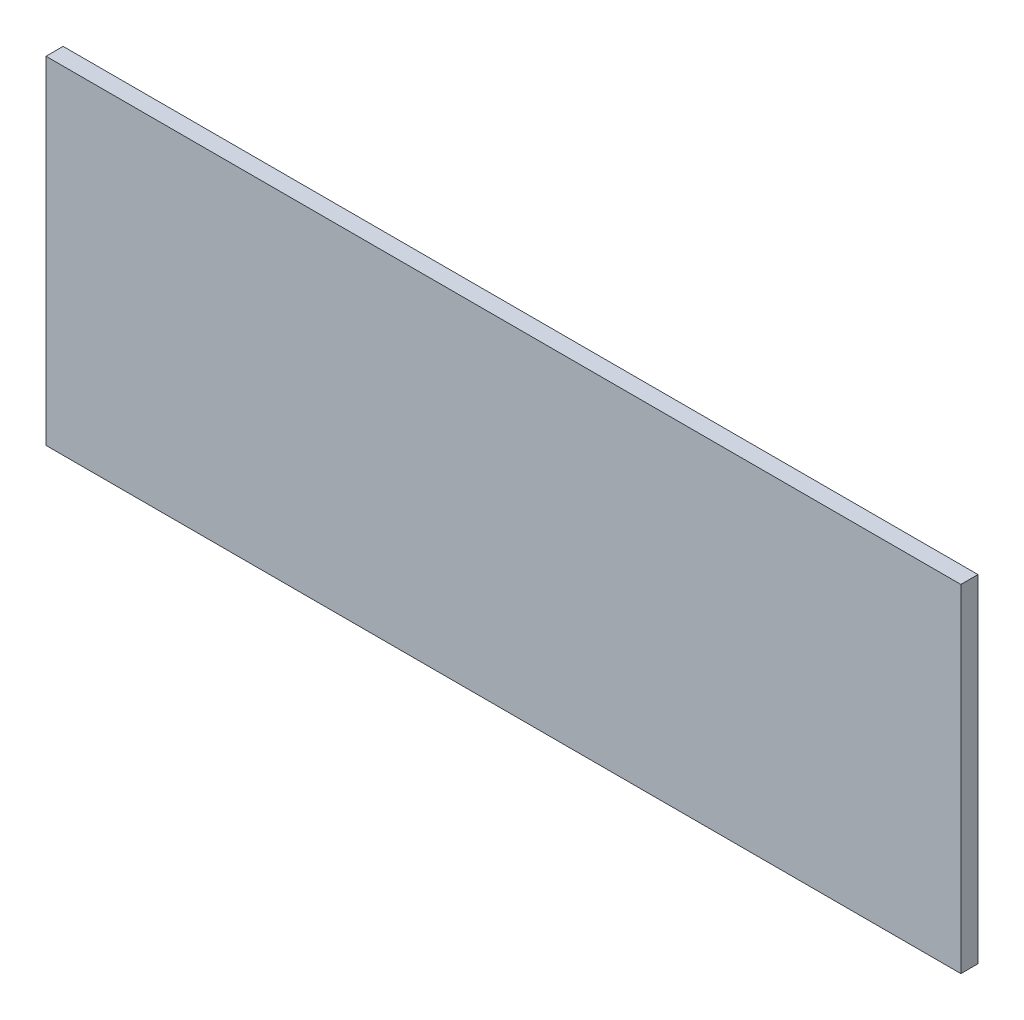
ISO-10303-21;
HEADER;
FILE_DESCRIPTION(('STEP AP214'),'2;1');
FILE_NAME('part.step','',(''),(''),'','','');
FILE_SCHEMA(('AUTOMOTIVE_DESIGN { 1 0 10303 214 1 1 1 1 }'));
ENDSEC;
DATA;
#1=APPLICATION_CONTEXT('core data for automotive mechanical design processes');
#2=APPLICATION_PROTOCOL_DEFINITION('international standard','automotive_design',2000,#1);
#3=PRODUCT_CONTEXT('',#1,'mechanical');
#4=PRODUCT('Part','Part','',(#3));
#5=PRODUCT_RELATED_PRODUCT_CATEGORY('part','',(#4));
#6=PRODUCT_DEFINITION_FORMATION('','',#4);
#7=PRODUCT_DEFINITION_CONTEXT('part definition',#1,'design');
#8=PRODUCT_DEFINITION('design','',#6,#7);
#9=PRODUCT_DEFINITION_SHAPE('','',#8);
#10=(LENGTH_UNIT() NAMED_UNIT(*) SI_UNIT(.MILLI.,.METRE.));
#11=(NAMED_UNIT(*) PLANE_ANGLE_UNIT() SI_UNIT($,.RADIAN.));
#12=(NAMED_UNIT(*) SI_UNIT($,.STERADIAN.) SOLID_ANGLE_UNIT());
#13=UNCERTAINTY_MEASURE_WITH_UNIT(LENGTH_MEASURE(1.E-05),#10,'distance_accuracy_value','');
#14=(GEOMETRIC_REPRESENTATION_CONTEXT(3) GLOBAL_UNCERTAINTY_ASSIGNED_CONTEXT((#13)) GLOBAL_UNIT_ASSIGNED_CONTEXT((#10,
#11,#12)) REPRESENTATION_CONTEXT('',''));
#15=CARTESIAN_POINT('',(0.,0.,0.));
#16=DIRECTION('',(0.,0.,1.));
#17=DIRECTION('',(1.,0.,0.));
#18=AXIS2_PLACEMENT_3D('',#15,#16,#17);
#19=CARTESIAN_POINT('',(96.5670013427734,71.3369979858398,0.));
#20=DIRECTION('',(0.,1.,0.));
#21=DIRECTION('',(1.,0.,0.));
#22=AXIS2_PLACEMENT_3D('',#19,#20,#21);
#23=PLANE('',#22);
#24=DIRECTION('',(1.,0.,0.));
#25=VECTOR('',#24,1.);
#26=CARTESIAN_POINT('',(96.5670013427734,71.3369979858398,0.03556));
#27=LINE('',#26,#25);
#28=CARTESIAN_POINT('',(96.5670013427734,71.3369979858398,0.03556));
#29=VERTEX_POINT('',#28);
#30=CARTESIAN_POINT('',(98.4670028686523,71.3369979858398,0.03556));
#31=VERTEX_POINT('',#30);
#32=EDGE_CURVE('E11',#29,#31,#27,.T.);
#33=ORIENTED_EDGE('',*,*,#32,.F.);
#34=DIRECTION('',(0.,0.,1.));
#35=VECTOR('',#34,1.);
#36=CARTESIAN_POINT('',(96.5670013427734,71.3369979858398,0.));
#37=LINE('',#36,#35);
#38=CARTESIAN_POINT('',(96.5670013427734,71.3369979858398,0.));
#39=VERTEX_POINT('',#38);
#40=EDGE_CURVE('E24',#39,#29,#37,.T.);
#41=ORIENTED_EDGE('',*,*,#40,.F.);
#42=DIRECTION('',(1.,0.,0.));
#43=VECTOR('',#42,1.);
#44=CARTESIAN_POINT('',(96.5670013427734,71.3369979858398,0.));
#45=LINE('',#44,#43);
#46=CARTESIAN_POINT('',(98.4670028686523,71.3369979858398,0.));
#47=VERTEX_POINT('',#46);
#48=EDGE_CURVE('E75',#39,#47,#45,.T.);
#49=ORIENTED_EDGE('',*,*,#48,.T.);
#50=DIRECTION('',(0.,0.,1.));
#51=VECTOR('',#50,1.);
#52=CARTESIAN_POINT('',(98.4670028686523,71.3369979858398,0.));
#53=LINE('',#52,#51);
#54=EDGE_CURVE('E37',#47,#31,#53,.T.);
#55=ORIENTED_EDGE('',*,*,#54,.T.);
#56=EDGE_LOOP('',(#33,#41,#49,#55));
#57=FACE_BOUND('',#56,.T.);
#58=ADVANCED_FACE('F17',(#57),#23,.F.);
#59=CARTESIAN_POINT('',(98.4670028686523,71.3369979858398,0.));
#60=DIRECTION('',(-1.,0.,0.));
#61=DIRECTION('',(0.,1.,0.));
#62=AXIS2_PLACEMENT_3D('',#59,#60,#61);
#63=PLANE('',#62);
#64=DIRECTION('',(0.,1.,0.));
#65=VECTOR('',#64,1.);
#66=CARTESIAN_POINT('',(98.4670028686523,71.3369979858398,0.03556));
#67=LINE('',#66,#65);
#68=CARTESIAN_POINT('',(98.4670028686523,72.0370025634766,0.03556));
#69=VERTEX_POINT('',#68);
#70=EDGE_CURVE('E83',#31,#69,#67,.T.);
#71=ORIENTED_EDGE('',*,*,#70,.F.);
#72=ORIENTED_EDGE('',*,*,#54,.F.);
#73=DIRECTION('',(0.,1.,0.));
#74=VECTOR('',#73,1.);
#75=CARTESIAN_POINT('',(98.4670028686523,71.3369979858398,0.));
#76=LINE('',#75,#74);
#77=CARTESIAN_POINT('',(98.4670028686523,72.0370025634766,0.));
#78=VERTEX_POINT('',#77);
#79=EDGE_CURVE('E81',#47,#78,#76,.T.);
#80=ORIENTED_EDGE('',*,*,#79,.T.);
#81=DIRECTION('',(0.,0.,1.));
#82=VECTOR('',#81,1.);
#83=CARTESIAN_POINT('',(98.4670028686523,72.0370025634766,0.));
#84=LINE('',#83,#82);
#85=EDGE_CURVE('E67',#78,#69,#84,.T.);
#86=ORIENTED_EDGE('',*,*,#85,.T.);
#87=EDGE_LOOP('',(#71,#72,#80,#86));
#88=FACE_BOUND('',#87,.T.);
#89=ADVANCED_FACE('F89',(#88),#63,.F.);
#90=CARTESIAN_POINT('',(98.4670028686523,72.0370025634766,0.));
#91=DIRECTION('',(0.,-1.,0.));
#92=DIRECTION('',(-1.,0.,0.));
#93=AXIS2_PLACEMENT_3D('',#90,#91,#92);
#94=PLANE('',#93);
#95=DIRECTION('',(-1.,0.,0.));
#96=VECTOR('',#95,1.);
#97=CARTESIAN_POINT('',(98.4670028686523,72.0370025634766,0.03556));
#98=LINE('',#97,#96);
#99=CARTESIAN_POINT('',(96.5670013427734,72.0370025634766,0.03556));
#100=VERTEX_POINT('',#99);
#101=EDGE_CURVE('E71',#69,#100,#98,.T.);
#102=ORIENTED_EDGE('',*,*,#101,.F.);
#103=ORIENTED_EDGE('',*,*,#85,.F.);
#104=DIRECTION('',(-1.,0.,0.));
#105=VECTOR('',#104,1.);
#106=CARTESIAN_POINT('',(98.4670028686523,72.0370025634766,0.));
#107=LINE('',#106,#105);
#108=CARTESIAN_POINT('',(96.5670013427734,72.0370025634766,0.));
#109=VERTEX_POINT('',#108);
#110=EDGE_CURVE('E63',#78,#109,#107,.T.);
#111=ORIENTED_EDGE('',*,*,#110,.T.);
#112=DIRECTION('',(0.,0.,1.));
#113=VECTOR('',#112,1.);
#114=CARTESIAN_POINT('',(96.5670013427734,72.0370025634766,0.));
#115=LINE('',#114,#113);
#116=EDGE_CURVE('E53',#109,#100,#115,.T.);
#117=ORIENTED_EDGE('',*,*,#116,.T.);
#118=EDGE_LOOP('',(#102,#103,#111,#117));
#119=FACE_BOUND('',#118,.T.);
#120=ADVANCED_FACE('F66',(#119),#94,.F.);
#121=CARTESIAN_POINT('',(96.5670013427734,72.0370025634766,0.));
#122=DIRECTION('',(1.,0.,0.));
#123=DIRECTION('',(0.,-1.,0.));
#124=AXIS2_PLACEMENT_3D('',#121,#122,#123);
#125=PLANE('',#124);
#126=DIRECTION('',(0.,-1.,0.));
#127=VECTOR('',#126,1.);
#128=CARTESIAN_POINT('',(96.5670013427734,72.0370025634766,0.03556));
#129=LINE('',#128,#127);
#130=EDGE_CURVE('E59',#100,#29,#129,.T.);
#131=ORIENTED_EDGE('',*,*,#130,.F.);
#132=ORIENTED_EDGE('',*,*,#116,.F.);
#133=DIRECTION('',(0.,-1.,0.));
#134=VECTOR('',#133,1.);
#135=CARTESIAN_POINT('',(96.5670013427734,72.0370025634766,0.));
#136=LINE('',#135,#134);
#137=EDGE_CURVE('E57',#109,#39,#136,.T.);
#138=ORIENTED_EDGE('',*,*,#137,.T.);
#139=ORIENTED_EDGE('',*,*,#40,.T.);
#140=EDGE_LOOP('',(#131,#132,#138,#139));
#141=FACE_BOUND('',#140,.T.);
#142=ADVANCED_FACE('F55',(#141),#125,.F.);
#143=CARTESIAN_POINT('',(96.5670013427734,71.3369979858398,0.));
#144=DIRECTION('',(0.,0.,-1.));
#145=DIRECTION('',(-1.,0.,0.));
#146=AXIS2_PLACEMENT_3D('',#143,#144,#145);
#147=PLANE('',#146);
#148=ORIENTED_EDGE('',*,*,#137,.F.);
#149=ORIENTED_EDGE('',*,*,#110,.F.);
#150=ORIENTED_EDGE('',*,*,#79,.F.);
#151=ORIENTED_EDGE('',*,*,#48,.F.);
#152=EDGE_LOOP('',(#148,#149,#150,#151));
#153=FACE_BOUND('',#152,.T.);
#154=ADVANCED_FACE('F74',(#153),#147,.T.);
#155=CARTESIAN_POINT('',(96.5670013427734,71.3369979858398,0.03556));
#156=DIRECTION('',(0.,0.,-1.));
#157=DIRECTION('',(-1.,0.,0.));
#158=AXIS2_PLACEMENT_3D('',#155,#156,#157);
#159=PLANE('',#158);
#160=ORIENTED_EDGE('',*,*,#32,.T.);
#161=ORIENTED_EDGE('',*,*,#70,.T.);
#162=ORIENTED_EDGE('',*,*,#101,.T.);
#163=ORIENTED_EDGE('',*,*,#130,.T.);
#164=EDGE_LOOP('',(#160,#161,#162,#163));
#165=FACE_BOUND('',#164,.T.);
#166=ADVANCED_FACE('F91',(#165),#159,.F.);
#167=CLOSED_SHELL('',(#58,#89,#120,#142,#154,#166));
#168=MANIFOLD_SOLID_BREP('B1',#167);
#169=ADVANCED_BREP_SHAPE_REPRESENTATION('',(#18,#168),#14);
#170=SHAPE_DEFINITION_REPRESENTATION(#9,#169);
ENDSEC;
END-ISO-10303-21;
